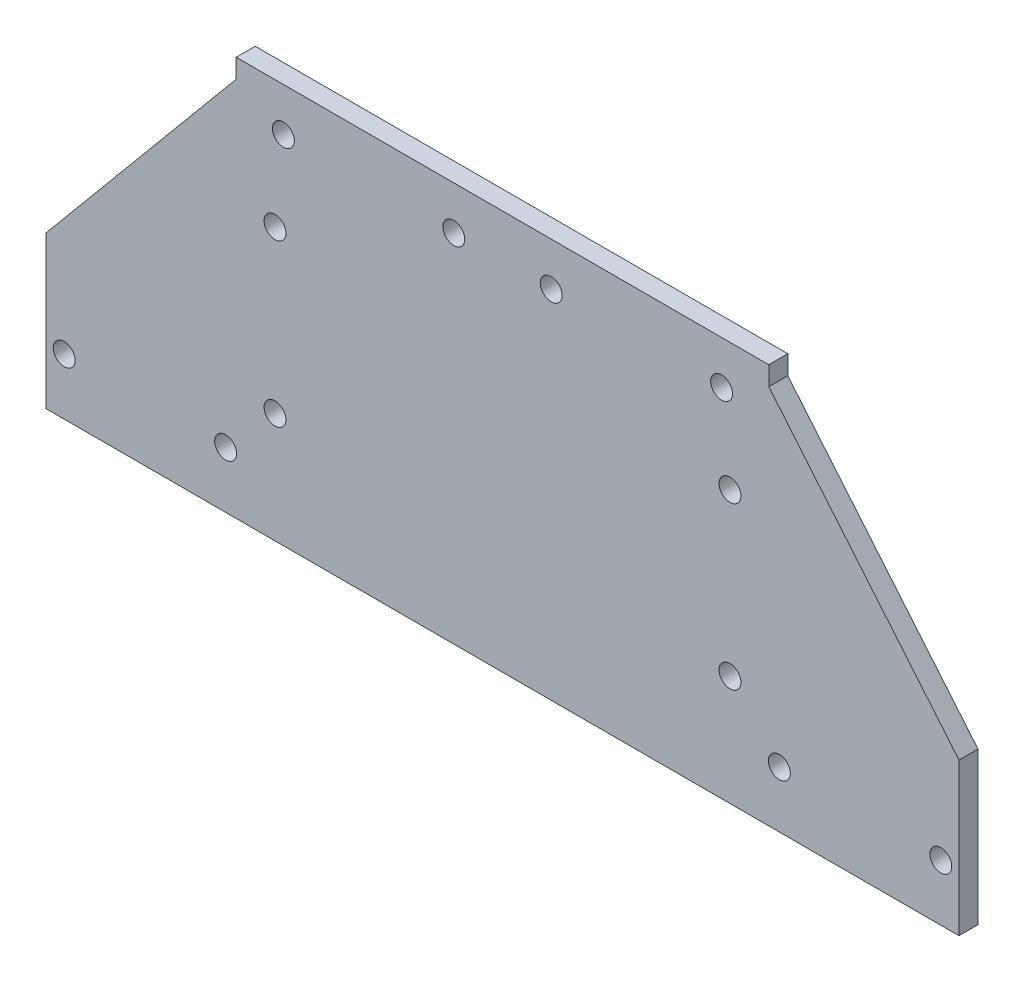
ISO-10303-21;
HEADER;
FILE_DESCRIPTION(('STEP AP214'),'2;1');
FILE_NAME('part.step','',(''),(''),'','','');
FILE_SCHEMA(('AUTOMOTIVE_DESIGN { 1 0 10303 214 1 1 1 1 }'));
ENDSEC;
DATA;
#1=APPLICATION_CONTEXT('core data for automotive mechanical design processes');
#2=APPLICATION_PROTOCOL_DEFINITION('international standard','automotive_design',2000,#1);
#3=PRODUCT_CONTEXT('',#1,'mechanical');
#4=PRODUCT('Part','Part','',(#3));
#5=PRODUCT_RELATED_PRODUCT_CATEGORY('part','',(#4));
#6=PRODUCT_DEFINITION_FORMATION('','',#4);
#7=PRODUCT_DEFINITION_CONTEXT('part definition',#1,'design');
#8=PRODUCT_DEFINITION('design','',#6,#7);
#9=PRODUCT_DEFINITION_SHAPE('','',#8);
#10=(LENGTH_UNIT() NAMED_UNIT(*) SI_UNIT(.MILLI.,.METRE.));
#11=(NAMED_UNIT(*) PLANE_ANGLE_UNIT() SI_UNIT($,.RADIAN.));
#12=(NAMED_UNIT(*) SI_UNIT($,.STERADIAN.) SOLID_ANGLE_UNIT());
#13=UNCERTAINTY_MEASURE_WITH_UNIT(LENGTH_MEASURE(1.E-05),#10,'distance_accuracy_value','');
#14=(GEOMETRIC_REPRESENTATION_CONTEXT(3) GLOBAL_UNCERTAINTY_ASSIGNED_CONTEXT((#13)) GLOBAL_UNIT_ASSIGNED_CONTEXT((#10,
#11,#12)) REPRESENTATION_CONTEXT('',''));
#15=CARTESIAN_POINT('',(0.,0.,0.));
#16=DIRECTION('',(0.,0.,1.));
#17=DIRECTION('',(1.,0.,0.));
#18=AXIS2_PLACEMENT_3D('',#15,#16,#17);
#19=CARTESIAN_POINT('',(44.45,51.435,1.58749999999999));
#20=DIRECTION('',(0.,0.,-1.));
#21=DIRECTION('',(-1.,0.,0.));
#22=AXIS2_PLACEMENT_3D('',#19,#20,#21);
#23=PLANE('',#22);
#24=CARTESIAN_POINT('',(73.1647,-5.84200000000002,1.5875));
#25=DIRECTION('',(0.,0.,1.));
#26=DIRECTION('',(-1.,0.,0.));
#27=AXIS2_PLACEMENT_3D('',#24,#25,#26);
#28=CIRCLE('',#27,1.82880000000003);
#29=CARTESIAN_POINT('',(71.3359,-5.84200000000002,1.5875));
#30=VERTEX_POINT('',#29);
#31=EDGE_CURVE('E228',#30,#30,#28,.T.);
#32=ORIENTED_EDGE('',*,*,#31,.F.);
#33=EDGE_LOOP('',(#32));
#34=FACE_BOUND('',#33,.T.);
#35=CARTESIAN_POINT('',(46.2153,-5.84200000000002,1.5875));
#36=DIRECTION('',(0.,0.,1.));
#37=DIRECTION('',(-1.,0.,0.));
#38=AXIS2_PLACEMENT_3D('',#35,#36,#37);
#39=CIRCLE('',#38,1.8288);
#40=CARTESIAN_POINT('',(44.3865,-5.84200000000002,1.5875));
#41=VERTEX_POINT('',#40);
#42=EDGE_CURVE('E222',#41,#41,#39,.T.);
#43=ORIENTED_EDGE('',*,*,#42,.F.);
#44=EDGE_LOOP('',(#43));
#45=FACE_BOUND('',#44,.T.);
#46=CARTESIAN_POINT('',(-46.2153,-5.84200000000001,1.5875));
#47=DIRECTION('',(0.,0.,1.));
#48=DIRECTION('',(1.,0.,0.));
#49=AXIS2_PLACEMENT_3D('',#46,#47,#48);
#50=CIRCLE('',#49,1.8288);
#51=CARTESIAN_POINT('',(-44.3865,-5.84200000000001,1.5875));
#52=VERTEX_POINT('',#51);
#53=EDGE_CURVE('E216',#52,#52,#50,.T.);
#54=ORIENTED_EDGE('',*,*,#53,.F.);
#55=EDGE_LOOP('',(#54));
#56=FACE_BOUND('',#55,.T.);
#57=CARTESIAN_POINT('',(-73.1647,-5.84200000000001,1.5875));
#58=DIRECTION('',(0.,0.,1.));
#59=DIRECTION('',(1.,0.,0.));
#60=AXIS2_PLACEMENT_3D('',#57,#58,#59);
#61=CIRCLE('',#60,1.8288);
#62=CARTESIAN_POINT('',(-71.3359,-5.84200000000001,1.5875));
#63=VERTEX_POINT('',#62);
#64=EDGE_CURVE('E210',#63,#63,#61,.T.);
#65=ORIENTED_EDGE('',*,*,#64,.F.);
#66=EDGE_LOOP('',(#65));
#67=FACE_BOUND('',#66,.T.);
#68=CARTESIAN_POINT('',(-36.576,44.196,1.5875));
#69=DIRECTION('',(0.,0.,1.));
#70=DIRECTION('',(1.,0.,0.));
#71=AXIS2_PLACEMENT_3D('',#68,#69,#70);
#72=CIRCLE('',#71,1.8288);
#73=CARTESIAN_POINT('',(-34.7472,44.196,1.5875));
#74=VERTEX_POINT('',#73);
#75=EDGE_CURVE('E131',#74,#74,#72,.T.);
#76=ORIENTED_EDGE('',*,*,#75,.F.);
#77=EDGE_LOOP('',(#76));
#78=FACE_BOUND('',#77,.T.);
#79=CARTESIAN_POINT('',(-8.128,44.196,1.5875));
#80=DIRECTION('',(0.,0.,1.));
#81=DIRECTION('',(1.,0.,0.));
#82=AXIS2_PLACEMENT_3D('',#79,#80,#81);
#83=CIRCLE('',#82,1.8288);
#84=CARTESIAN_POINT('',(-6.2992,44.196,1.5875));
#85=VERTEX_POINT('',#84);
#86=EDGE_CURVE('E137',#85,#85,#83,.T.);
#87=ORIENTED_EDGE('',*,*,#86,.F.);
#88=EDGE_LOOP('',(#87));
#89=FACE_BOUND('',#88,.T.);
#90=CARTESIAN_POINT('',(8.128,44.196,1.5875));
#91=DIRECTION('',(0.,0.,1.));
#92=DIRECTION('',(-1.,0.,0.));
#93=AXIS2_PLACEMENT_3D('',#90,#91,#92);
#94=CIRCLE('',#93,1.8288);
#95=CARTESIAN_POINT('',(6.2992,44.196,1.5875));
#96=VERTEX_POINT('',#95);
#97=EDGE_CURVE('E143',#96,#96,#94,.T.);
#98=ORIENTED_EDGE('',*,*,#97,.F.);
#99=EDGE_LOOP('',(#98));
#100=FACE_BOUND('',#99,.T.);
#101=CARTESIAN_POINT('',(36.576,44.196,1.5875));
#102=DIRECTION('',(0.,0.,1.));
#103=DIRECTION('',(-1.,0.,0.));
#104=AXIS2_PLACEMENT_3D('',#101,#102,#103);
#105=CIRCLE('',#104,1.8288);
#106=CARTESIAN_POINT('',(34.7472,44.196,1.5875));
#107=VERTEX_POINT('',#106);
#108=EDGE_CURVE('E149',#107,#107,#105,.T.);
#109=ORIENTED_EDGE('',*,*,#108,.F.);
#110=EDGE_LOOP('',(#109));
#111=FACE_BOUND('',#110,.T.);
#112=CARTESIAN_POINT('',(-37.973,3.175,1.5875));
#113=DIRECTION('',(0.,0.,1.));
#114=DIRECTION('',(1.,0.,0.));
#115=AXIS2_PLACEMENT_3D('',#112,#113,#114);
#116=CIRCLE('',#115,1.8288);
#117=CARTESIAN_POINT('',(-36.1442,3.175,1.5875));
#118=VERTEX_POINT('',#117);
#119=EDGE_CURVE('E155',#118,#118,#116,.T.);
#120=ORIENTED_EDGE('',*,*,#119,.F.);
#121=EDGE_LOOP('',(#120));
#122=FACE_BOUND('',#121,.T.);
#123=CARTESIAN_POINT('',(-37.973,30.1244,1.5875));
#124=DIRECTION('',(0.,0.,1.));
#125=DIRECTION('',(1.,0.,0.));
#126=AXIS2_PLACEMENT_3D('',#123,#124,#125);
#127=CIRCLE('',#126,1.8288);
#128=CARTESIAN_POINT('',(-36.1442,30.1244,1.5875));
#129=VERTEX_POINT('',#128);
#130=EDGE_CURVE('E161',#129,#129,#127,.T.);
#131=ORIENTED_EDGE('',*,*,#130,.F.);
#132=EDGE_LOOP('',(#131));
#133=FACE_BOUND('',#132,.T.);
#134=CARTESIAN_POINT('',(37.973,3.17500000000001,1.5875));
#135=DIRECTION('',(0.,0.,1.));
#136=DIRECTION('',(-1.,0.,0.));
#137=AXIS2_PLACEMENT_3D('',#134,#135,#136);
#138=CIRCLE('',#137,1.8288);
#139=CARTESIAN_POINT('',(36.1442,3.17500000000001,1.5875));
#140=VERTEX_POINT('',#139);
#141=EDGE_CURVE('E167',#140,#140,#138,.T.);
#142=ORIENTED_EDGE('',*,*,#141,.F.);
#143=EDGE_LOOP('',(#142));
#144=FACE_BOUND('',#143,.T.);
#145=CARTESIAN_POINT('',(37.973,30.1244,1.5875));
#146=DIRECTION('',(0.,0.,1.));
#147=DIRECTION('',(-1.,0.,0.));
#148=AXIS2_PLACEMENT_3D('',#145,#146,#147);
#149=CIRCLE('',#148,1.8288);
#150=CARTESIAN_POINT('',(36.1442,30.1244,1.5875));
#151=VERTEX_POINT('',#150);
#152=EDGE_CURVE('E114',#151,#151,#149,.T.);
#153=ORIENTED_EDGE('',*,*,#152,.F.);
#154=EDGE_LOOP('',(#153));
#155=FACE_BOUND('',#154,.T.);
#156=DIRECTION('',(0.,1.,0.));
#157=VECTOR('',#156,1.);
#158=CARTESIAN_POINT('',(76.2,0.,1.5875));
#159=LINE('',#158,#157);
#160=CARTESIAN_POINT('',(76.2,-15.24,1.5875));
#161=VERTEX_POINT('',#160);
#162=CARTESIAN_POINT('',(76.2,10.16,1.5875));
#163=VERTEX_POINT('',#162);
#164=EDGE_CURVE('E186',#161,#163,#159,.T.);
#165=ORIENTED_EDGE('',*,*,#164,.T.);
#166=DIRECTION('',(0.64018439966448,-0.768221279597376,0.));
#167=VECTOR('',#166,1.);
#168=CARTESIAN_POINT('',(49.9672131147541,41.6393442622951,1.5875));
#169=LINE('',#168,#167);
#170=CARTESIAN_POINT('',(44.45,48.26,1.5875));
#171=VERTEX_POINT('',#170);
#172=EDGE_CURVE('E48',#171,#163,#169,.T.);
#173=ORIENTED_EDGE('',*,*,#172,.F.);
#174=DIRECTION('',(0.,-1.,0.));
#175=VECTOR('',#174,1.);
#176=CARTESIAN_POINT('',(44.45,51.435,1.58749999999999));
#177=LINE('',#176,#175);
#178=CARTESIAN_POINT('',(44.45,51.435,1.58749999999999));
#179=VERTEX_POINT('',#178);
#180=EDGE_CURVE('E41',#179,#171,#177,.T.);
#181=ORIENTED_EDGE('',*,*,#180,.F.);
#182=DIRECTION('',(1.,0.,0.));
#183=VECTOR('',#182,1.);
#184=CARTESIAN_POINT('',(44.45,51.435,1.58749999999999));
#185=LINE('',#184,#183);
#186=CARTESIAN_POINT('',(-44.45,51.435,1.58750000000001));
#187=VERTEX_POINT('',#186);
#188=EDGE_CURVE('E126',#187,#179,#185,.T.);
#189=ORIENTED_EDGE('',*,*,#188,.F.);
#190=DIRECTION('',(0.,-1.,0.));
#191=VECTOR('',#190,1.);
#192=CARTESIAN_POINT('',(-44.45,51.435,1.58750000000001));
#193=LINE('',#192,#191);
#194=CARTESIAN_POINT('',(-44.45,48.26,1.5875));
#195=VERTEX_POINT('',#194);
#196=EDGE_CURVE('E11',#187,#195,#193,.T.);
#197=ORIENTED_EDGE('',*,*,#196,.T.);
#198=DIRECTION('',(-0.64018439966448,-0.768221279597376,0.));
#199=VECTOR('',#198,1.);
#200=CARTESIAN_POINT('',(-49.9672131147541,41.6393442622951,1.5875));
#201=LINE('',#200,#199);
#202=CARTESIAN_POINT('',(-76.2,10.16,1.5875));
#203=VERTEX_POINT('',#202);
#204=EDGE_CURVE('E203',#195,#203,#201,.T.);
#205=ORIENTED_EDGE('',*,*,#204,.T.);
#206=DIRECTION('',(0.,-1.,0.));
#207=VECTOR('',#206,1.);
#208=CARTESIAN_POINT('',(-76.2,0.,1.5875));
#209=LINE('',#208,#207);
#210=CARTESIAN_POINT('',(-76.2,-15.24,1.5875));
#211=VERTEX_POINT('',#210);
#212=EDGE_CURVE('E193',#203,#211,#209,.T.);
#213=ORIENTED_EDGE('',*,*,#212,.T.);
#214=DIRECTION('',(1.,0.,0.));
#215=VECTOR('',#214,1.);
#216=CARTESIAN_POINT('',(76.2,-15.24,1.5875));
#217=LINE('',#216,#215);
#218=EDGE_CURVE('E190',#211,#161,#217,.T.);
#219=ORIENTED_EDGE('',*,*,#218,.T.);
#220=EDGE_LOOP('',(#165,#173,#181,#189,#197,#205,#213,#219));
#221=FACE_BOUND('',#220,.T.);
#222=ADVANCED_FACE('F33',(#34,#45,#56,#67,#78,#89,#100,#111,#122,#133,#144,#155,#221),#23,.F.);
#223=CARTESIAN_POINT('',(44.45,51.435,-1.58750000000001));
#224=DIRECTION('',(0.,0.,1.));
#225=DIRECTION('',(1.,0.,0.));
#226=AXIS2_PLACEMENT_3D('',#223,#224,#225);
#227=PLANE('',#226);
#228=CARTESIAN_POINT('',(73.1647,-5.84200000000002,-1.58750000000001));
#229=DIRECTION('',(0.,0.,1.));
#230=DIRECTION('',(-1.,0.,0.));
#231=AXIS2_PLACEMENT_3D('',#228,#229,#230);
#232=CIRCLE('',#231,1.82880000000003);
#233=CARTESIAN_POINT('',(71.3359,-5.84200000000002,-1.58750000000001));
#234=VERTEX_POINT('',#233);
#235=EDGE_CURVE('E225',#234,#234,#232,.T.);
#236=ORIENTED_EDGE('',*,*,#235,.T.);
#237=EDGE_LOOP('',(#236));
#238=FACE_BOUND('',#237,.T.);
#239=CARTESIAN_POINT('',(46.2153,-5.84200000000002,-1.58750000000001));
#240=DIRECTION('',(0.,0.,1.));
#241=DIRECTION('',(-1.,0.,0.));
#242=AXIS2_PLACEMENT_3D('',#239,#240,#241);
#243=CIRCLE('',#242,1.8288);
#244=CARTESIAN_POINT('',(44.3865,-5.84200000000002,-1.58750000000001));
#245=VERTEX_POINT('',#244);
#246=EDGE_CURVE('E219',#245,#245,#243,.T.);
#247=ORIENTED_EDGE('',*,*,#246,.T.);
#248=EDGE_LOOP('',(#247));
#249=FACE_BOUND('',#248,.T.);
#250=CARTESIAN_POINT('',(-46.2153,-5.84200000000001,-1.58750000000001));
#251=DIRECTION('',(0.,0.,1.));
#252=DIRECTION('',(1.,0.,0.));
#253=AXIS2_PLACEMENT_3D('',#250,#251,#252);
#254=CIRCLE('',#253,1.8288);
#255=CARTESIAN_POINT('',(-44.3865,-5.84200000000001,-1.58750000000001));
#256=VERTEX_POINT('',#255);
#257=EDGE_CURVE('E213',#256,#256,#254,.T.);
#258=ORIENTED_EDGE('',*,*,#257,.T.);
#259=EDGE_LOOP('',(#258));
#260=FACE_BOUND('',#259,.T.);
#261=CARTESIAN_POINT('',(-73.1647,-5.84200000000001,-1.58750000000001));
#262=DIRECTION('',(0.,0.,1.));
#263=DIRECTION('',(1.,0.,0.));
#264=AXIS2_PLACEMENT_3D('',#261,#262,#263);
#265=CIRCLE('',#264,1.8288);
#266=CARTESIAN_POINT('',(-71.3359,-5.84200000000001,-1.58750000000001));
#267=VERTEX_POINT('',#266);
#268=EDGE_CURVE('E208',#267,#267,#265,.T.);
#269=ORIENTED_EDGE('',*,*,#268,.T.);
#270=EDGE_LOOP('',(#269));
#271=FACE_BOUND('',#270,.T.);
#272=CARTESIAN_POINT('',(-36.576,44.196,-1.58750000000001));
#273=DIRECTION('',(0.,0.,1.));
#274=DIRECTION('',(1.,0.,0.));
#275=AXIS2_PLACEMENT_3D('',#272,#273,#274);
#276=CIRCLE('',#275,1.8288);
#277=CARTESIAN_POINT('',(-34.7472,44.196,-1.58750000000001));
#278=VERTEX_POINT('',#277);
#279=EDGE_CURVE('E130',#278,#278,#276,.T.);
#280=ORIENTED_EDGE('',*,*,#279,.T.);
#281=EDGE_LOOP('',(#280));
#282=FACE_BOUND('',#281,.T.);
#283=CARTESIAN_POINT('',(-8.128,44.196,-1.58750000000001));
#284=DIRECTION('',(0.,0.,1.));
#285=DIRECTION('',(1.,0.,0.));
#286=AXIS2_PLACEMENT_3D('',#283,#284,#285);
#287=CIRCLE('',#286,1.8288);
#288=CARTESIAN_POINT('',(-6.2992,44.196,-1.58750000000001));
#289=VERTEX_POINT('',#288);
#290=EDGE_CURVE('E134',#289,#289,#287,.T.);
#291=ORIENTED_EDGE('',*,*,#290,.T.);
#292=EDGE_LOOP('',(#291));
#293=FACE_BOUND('',#292,.T.);
#294=CARTESIAN_POINT('',(8.128,44.196,-1.58750000000001));
#295=DIRECTION('',(0.,0.,1.));
#296=DIRECTION('',(-1.,0.,0.));
#297=AXIS2_PLACEMENT_3D('',#294,#295,#296);
#298=CIRCLE('',#297,1.8288);
#299=CARTESIAN_POINT('',(6.2992,44.196,-1.58750000000001));
#300=VERTEX_POINT('',#299);
#301=EDGE_CURVE('E140',#300,#300,#298,.T.);
#302=ORIENTED_EDGE('',*,*,#301,.T.);
#303=EDGE_LOOP('',(#302));
#304=FACE_BOUND('',#303,.T.);
#305=CARTESIAN_POINT('',(36.576,44.196,-1.58750000000001));
#306=DIRECTION('',(0.,0.,1.));
#307=DIRECTION('',(-1.,0.,0.));
#308=AXIS2_PLACEMENT_3D('',#305,#306,#307);
#309=CIRCLE('',#308,1.8288);
#310=CARTESIAN_POINT('',(34.7472,44.196,-1.58750000000001));
#311=VERTEX_POINT('',#310);
#312=EDGE_CURVE('E146',#311,#311,#309,.T.);
#313=ORIENTED_EDGE('',*,*,#312,.T.);
#314=EDGE_LOOP('',(#313));
#315=FACE_BOUND('',#314,.T.);
#316=CARTESIAN_POINT('',(-37.973,3.175,-1.58750000000001));
#317=DIRECTION('',(0.,0.,1.));
#318=DIRECTION('',(1.,0.,0.));
#319=AXIS2_PLACEMENT_3D('',#316,#317,#318);
#320=CIRCLE('',#319,1.8288);
#321=CARTESIAN_POINT('',(-36.1442,3.175,-1.58750000000001));
#322=VERTEX_POINT('',#321);
#323=EDGE_CURVE('E152',#322,#322,#320,.T.);
#324=ORIENTED_EDGE('',*,*,#323,.T.);
#325=EDGE_LOOP('',(#324));
#326=FACE_BOUND('',#325,.T.);
#327=CARTESIAN_POINT('',(-37.973,30.1244,-1.58750000000001));
#328=DIRECTION('',(0.,0.,1.));
#329=DIRECTION('',(1.,0.,0.));
#330=AXIS2_PLACEMENT_3D('',#327,#328,#329);
#331=CIRCLE('',#330,1.8288);
#332=CARTESIAN_POINT('',(-36.1442,30.1244,-1.58750000000001));
#333=VERTEX_POINT('',#332);
#334=EDGE_CURVE('E158',#333,#333,#331,.T.);
#335=ORIENTED_EDGE('',*,*,#334,.T.);
#336=EDGE_LOOP('',(#335));
#337=FACE_BOUND('',#336,.T.);
#338=CARTESIAN_POINT('',(37.973,3.17500000000001,-1.58750000000001));
#339=DIRECTION('',(0.,0.,1.));
#340=DIRECTION('',(-1.,0.,0.));
#341=AXIS2_PLACEMENT_3D('',#338,#339,#340);
#342=CIRCLE('',#341,1.8288);
#343=CARTESIAN_POINT('',(36.1442,3.17500000000001,-1.58750000000001));
#344=VERTEX_POINT('',#343);
#345=EDGE_CURVE('E164',#344,#344,#342,.T.);
#346=ORIENTED_EDGE('',*,*,#345,.T.);
#347=EDGE_LOOP('',(#346));
#348=FACE_BOUND('',#347,.T.);
#349=CARTESIAN_POINT('',(37.973,30.1244,-1.58750000000001));
#350=DIRECTION('',(0.,0.,1.));
#351=DIRECTION('',(-1.,0.,0.));
#352=AXIS2_PLACEMENT_3D('',#349,#350,#351);
#353=CIRCLE('',#352,1.8288);
#354=CARTESIAN_POINT('',(36.1442,30.1244,-1.58750000000001));
#355=VERTEX_POINT('',#354);
#356=EDGE_CURVE('E170',#355,#355,#353,.T.);
#357=ORIENTED_EDGE('',*,*,#356,.T.);
#358=EDGE_LOOP('',(#357));
#359=FACE_BOUND('',#358,.T.);
#360=DIRECTION('',(0.,-1.,0.));
#361=VECTOR('',#360,1.);
#362=CARTESIAN_POINT('',(44.45,51.435,-1.58750000000001));
#363=LINE('',#362,#361);
#364=CARTESIAN_POINT('',(44.45,51.435,-1.58750000000001));
#365=VERTEX_POINT('',#364);
#366=CARTESIAN_POINT('',(44.45,48.26,-1.58750000000001));
#367=VERTEX_POINT('',#366);
#368=EDGE_CURVE('E112',#365,#367,#363,.T.);
#369=ORIENTED_EDGE('',*,*,#368,.T.);
#370=DIRECTION('',(0.64018439966448,-0.768221279597376,0.));
#371=VECTOR('',#370,1.);
#372=CARTESIAN_POINT('',(49.9672131147541,41.6393442622951,-1.58750000000001));
#373=LINE('',#372,#371);
#374=CARTESIAN_POINT('',(76.2,10.16,-1.58750000000001));
#375=VERTEX_POINT('',#374);
#376=EDGE_CURVE('E97',#367,#375,#373,.T.);
#377=ORIENTED_EDGE('',*,*,#376,.T.);
#378=DIRECTION('',(0.,1.,0.));
#379=VECTOR('',#378,1.);
#380=CARTESIAN_POINT('',(76.2,0.,-1.5875));
#381=LINE('',#380,#379);
#382=CARTESIAN_POINT('',(76.2,-15.24,-1.5875));
#383=VERTEX_POINT('',#382);
#384=EDGE_CURVE('E181',#383,#375,#381,.T.);
#385=ORIENTED_EDGE('',*,*,#384,.F.);
#386=DIRECTION('',(1.,0.,0.));
#387=VECTOR('',#386,1.);
#388=CARTESIAN_POINT('',(76.2,-15.24,-1.5875));
#389=LINE('',#388,#387);
#390=CARTESIAN_POINT('',(-76.2,-15.24,-1.5875));
#391=VERTEX_POINT('',#390);
#392=EDGE_CURVE('E197',#391,#383,#389,.T.);
#393=ORIENTED_EDGE('',*,*,#392,.F.);
#394=DIRECTION('',(0.,-1.,0.));
#395=VECTOR('',#394,1.);
#396=CARTESIAN_POINT('',(-76.2,0.,-1.5875));
#397=LINE('',#396,#395);
#398=CARTESIAN_POINT('',(-76.2,10.16,-1.58750000000001));
#399=VERTEX_POINT('',#398);
#400=EDGE_CURVE('E189',#399,#391,#397,.T.);
#401=ORIENTED_EDGE('',*,*,#400,.F.);
#402=DIRECTION('',(-0.64018439966448,-0.768221279597376,0.));
#403=VECTOR('',#402,1.);
#404=CARTESIAN_POINT('',(-49.9672131147541,41.6393442622951,-1.58750000000001));
#405=LINE('',#404,#403);
#406=CARTESIAN_POINT('',(-44.45,48.26,-1.58750000000001));
#407=VERTEX_POINT('',#406);
#408=EDGE_CURVE('E202',#407,#399,#405,.T.);
#409=ORIENTED_EDGE('',*,*,#408,.F.);
#410=DIRECTION('',(0.,-1.,0.));
#411=VECTOR('',#410,1.);
#412=CARTESIAN_POINT('',(-44.45,51.435,-1.58749999999999));
#413=LINE('',#412,#411);
#414=CARTESIAN_POINT('',(-44.45,51.435,-1.58749999999999));
#415=VERTEX_POINT('',#414);
#416=EDGE_CURVE('E118',#415,#407,#413,.T.);
#417=ORIENTED_EDGE('',*,*,#416,.F.);
#418=DIRECTION('',(-1.,0.,0.));
#419=VECTOR('',#418,1.);
#420=CARTESIAN_POINT('',(44.45,51.435,-1.58750000000001));
#421=LINE('',#420,#419);
#422=EDGE_CURVE('E56',#365,#415,#421,.T.);
#423=ORIENTED_EDGE('',*,*,#422,.F.);
#424=EDGE_LOOP('',(#369,#377,#385,#393,#401,#409,#417,#423));
#425=FACE_BOUND('',#424,.T.);
#426=ADVANCED_FACE('F117',(#238,#249,#260,#271,#282,#293,#304,#315,#326,#337,#348,#359,#425),
#227,.F.);
#427=CARTESIAN_POINT('',(-76.2,0.,-1.5875));
#428=DIRECTION('',(-1.,0.,0.));
#429=DIRECTION('',(0.,0.,1.));
#430=AXIS2_PLACEMENT_3D('',#427,#428,#429);
#431=PLANE('',#430);
#432=ORIENTED_EDGE('',*,*,#212,.F.);
#433=DIRECTION('',(0.,0.,1.));
#434=VECTOR('',#433,1.);
#435=CARTESIAN_POINT('',(-76.2,10.16,-1.58750000000001));
#436=LINE('',#435,#434);
#437=EDGE_CURVE('E195',#399,#203,#436,.T.);
#438=ORIENTED_EDGE('',*,*,#437,.F.);
#439=ORIENTED_EDGE('',*,*,#400,.T.);
#440=DIRECTION('',(0.,0.,1.));
#441=VECTOR('',#440,1.);
#442=CARTESIAN_POINT('',(-76.2,-15.24,-1.5875));
#443=LINE('',#442,#441);
#444=EDGE_CURVE('E180',#391,#211,#443,.T.);
#445=ORIENTED_EDGE('',*,*,#444,.T.);
#446=EDGE_LOOP('',(#432,#438,#439,#445));
#447=FACE_BOUND('',#446,.T.);
#448=ADVANCED_FACE('F279',(#447),#431,.T.);
#449=CARTESIAN_POINT('',(-44.45,51.435,1.58750000000001));
#450=DIRECTION('',(1.,0.,0.));
#451=DIRECTION('',(0.,0.,-1.));
#452=AXIS2_PLACEMENT_3D('',#449,#450,#451);
#453=PLANE('',#452);
#454=ORIENTED_EDGE('',*,*,#416,.T.);
#455=DIRECTION('',(0.,0.,1.));
#456=VECTOR('',#455,1.);
#457=CARTESIAN_POINT('',(-44.45,48.26,-1.5875));
#458=LINE('',#457,#456);
#459=EDGE_CURVE('E177',#407,#195,#458,.T.);
#460=ORIENTED_EDGE('',*,*,#459,.T.);
#461=ORIENTED_EDGE('',*,*,#196,.F.);
#462=DIRECTION('',(0.,0.,1.));
#463=VECTOR('',#462,1.);
#464=CARTESIAN_POINT('',(-44.45,51.435,1.58750000000001));
#465=LINE('',#464,#463);
#466=EDGE_CURVE('E128',#415,#187,#465,.T.);
#467=ORIENTED_EDGE('',*,*,#466,.F.);
#468=EDGE_LOOP('',(#454,#460,#461,#467));
#469=FACE_BOUND('',#468,.T.);
#470=ADVANCED_FACE('F35',(#469),#453,.F.);
#471=CARTESIAN_POINT('',(44.45,51.435,1.58749999999999));
#472=DIRECTION('',(-1.,0.,0.));
#473=DIRECTION('',(0.,0.,1.));
#474=AXIS2_PLACEMENT_3D('',#471,#472,#473);
#475=PLANE('',#474);
#476=ORIENTED_EDGE('',*,*,#180,.T.);
#477=DIRECTION('',(0.,0.,1.));
#478=VECTOR('',#477,1.);
#479=CARTESIAN_POINT('',(44.45,48.26,-1.5875));
#480=LINE('',#479,#478);
#481=EDGE_CURVE('E100',#367,#171,#480,.T.);
#482=ORIENTED_EDGE('',*,*,#481,.F.);
#483=ORIENTED_EDGE('',*,*,#368,.F.);
#484=DIRECTION('',(0.,0.,-1.));
#485=VECTOR('',#484,1.);
#486=CARTESIAN_POINT('',(44.45,51.435,1.58749999999999));
#487=LINE('',#486,#485);
#488=EDGE_CURVE('E124',#179,#365,#487,.T.);
#489=ORIENTED_EDGE('',*,*,#488,.F.);
#490=EDGE_LOOP('',(#476,#482,#483,#489));
#491=FACE_BOUND('',#490,.T.);
#492=ADVANCED_FACE('F110',(#491),#475,.F.);
#493=CARTESIAN_POINT('',(0.,51.435,0.));
#494=DIRECTION('',(0.,1.,0.));
#495=DIRECTION('',(0.,0.,1.));
#496=AXIS2_PLACEMENT_3D('',#493,#494,#495);
#497=PLANE('',#496);
#498=ORIENTED_EDGE('',*,*,#466,.T.);
#499=ORIENTED_EDGE('',*,*,#188,.T.);
#500=ORIENTED_EDGE('',*,*,#488,.T.);
#501=ORIENTED_EDGE('',*,*,#422,.T.);
#502=EDGE_LOOP('',(#498,#499,#500,#501));
#503=FACE_BOUND('',#502,.T.);
#504=ADVANCED_FACE('F285',(#503),#497,.T.);
#505=CARTESIAN_POINT('',(-36.576,44.196,-1.58750000000001));
#506=DIRECTION('',(0.,0.,1.));
#507=DIRECTION('',(1.,0.,0.));
#508=AXIS2_PLACEMENT_3D('',#505,#506,#507);
#509=CYLINDRICAL_SURFACE('',#508,1.8288);
#510=ORIENTED_EDGE('',*,*,#279,.F.);
#511=EDGE_LOOP('',(#510));
#512=FACE_BOUND('',#511,.T.);
#513=ORIENTED_EDGE('',*,*,#75,.T.);
#514=EDGE_LOOP('',(#513));
#515=FACE_BOUND('',#514,.T.);
#516=ADVANCED_FACE('F287',(#512,#515),#509,.F.);
#517=CARTESIAN_POINT('',(-8.128,44.196,-1.58750000000001));
#518=DIRECTION('',(0.,0.,1.));
#519=DIRECTION('',(1.,0.,0.));
#520=AXIS2_PLACEMENT_3D('',#517,#518,#519);
#521=CYLINDRICAL_SURFACE('',#520,1.8288);
#522=ORIENTED_EDGE('',*,*,#290,.F.);
#523=EDGE_LOOP('',(#522));
#524=FACE_BOUND('',#523,.T.);
#525=ORIENTED_EDGE('',*,*,#86,.T.);
#526=EDGE_LOOP('',(#525));
#527=FACE_BOUND('',#526,.T.);
#528=ADVANCED_FACE('F293',(#524,#527),#521,.F.);
#529=CARTESIAN_POINT('',(8.128,44.196,-1.58750000000001));
#530=DIRECTION('',(0.,0.,1.));
#531=DIRECTION('',(1.,0.,0.));
#532=AXIS2_PLACEMENT_3D('',#529,#530,#531);
#533=CYLINDRICAL_SURFACE('',#532,1.8288);
#534=ORIENTED_EDGE('',*,*,#301,.F.);
#535=EDGE_LOOP('',(#534));
#536=FACE_BOUND('',#535,.T.);
#537=ORIENTED_EDGE('',*,*,#97,.T.);
#538=EDGE_LOOP('',(#537));
#539=FACE_BOUND('',#538,.T.);
#540=ADVANCED_FACE('F329',(#536,#539),#533,.F.);
#541=CARTESIAN_POINT('',(36.576,44.196,-1.58750000000001));
#542=DIRECTION('',(0.,0.,1.));
#543=DIRECTION('',(1.,0.,0.));
#544=AXIS2_PLACEMENT_3D('',#541,#542,#543);
#545=CYLINDRICAL_SURFACE('',#544,1.8288);
#546=ORIENTED_EDGE('',*,*,#312,.F.);
#547=EDGE_LOOP('',(#546));
#548=FACE_BOUND('',#547,.T.);
#549=ORIENTED_EDGE('',*,*,#108,.T.);
#550=EDGE_LOOP('',(#549));
#551=FACE_BOUND('',#550,.T.);
#552=ADVANCED_FACE('F325',(#548,#551),#545,.F.);
#553=CARTESIAN_POINT('',(-37.973,3.175,-1.58750000000001));
#554=DIRECTION('',(0.,0.,1.));
#555=DIRECTION('',(1.,0.,0.));
#556=AXIS2_PLACEMENT_3D('',#553,#554,#555);
#557=CYLINDRICAL_SURFACE('',#556,1.8288);
#558=ORIENTED_EDGE('',*,*,#323,.F.);
#559=EDGE_LOOP('',(#558));
#560=FACE_BOUND('',#559,.T.);
#561=ORIENTED_EDGE('',*,*,#119,.T.);
#562=EDGE_LOOP('',(#561));
#563=FACE_BOUND('',#562,.T.);
#564=ADVANCED_FACE('F321',(#560,#563),#557,.F.);
#565=CARTESIAN_POINT('',(-37.973,30.1244,-1.58750000000001));
#566=DIRECTION('',(0.,0.,1.));
#567=DIRECTION('',(1.,0.,0.));
#568=AXIS2_PLACEMENT_3D('',#565,#566,#567);
#569=CYLINDRICAL_SURFACE('',#568,1.8288);
#570=ORIENTED_EDGE('',*,*,#334,.F.);
#571=EDGE_LOOP('',(#570));
#572=FACE_BOUND('',#571,.T.);
#573=ORIENTED_EDGE('',*,*,#130,.T.);
#574=EDGE_LOOP('',(#573));
#575=FACE_BOUND('',#574,.T.);
#576=ADVANCED_FACE('F317',(#572,#575),#569,.F.);
#577=CARTESIAN_POINT('',(37.973,3.17500000000001,-1.58750000000001));
#578=DIRECTION('',(0.,0.,1.));
#579=DIRECTION('',(1.,0.,0.));
#580=AXIS2_PLACEMENT_3D('',#577,#578,#579);
#581=CYLINDRICAL_SURFACE('',#580,1.8288);
#582=ORIENTED_EDGE('',*,*,#345,.F.);
#583=EDGE_LOOP('',(#582));
#584=FACE_BOUND('',#583,.T.);
#585=ORIENTED_EDGE('',*,*,#141,.T.);
#586=EDGE_LOOP('',(#585));
#587=FACE_BOUND('',#586,.T.);
#588=ADVANCED_FACE('F313',(#584,#587),#581,.F.);
#589=CARTESIAN_POINT('',(37.973,30.1244,-1.58750000000001));
#590=DIRECTION('',(0.,0.,1.));
#591=DIRECTION('',(1.,0.,0.));
#592=AXIS2_PLACEMENT_3D('',#589,#590,#591);
#593=CYLINDRICAL_SURFACE('',#592,1.8288);
#594=ORIENTED_EDGE('',*,*,#356,.F.);
#595=EDGE_LOOP('',(#594));
#596=FACE_BOUND('',#595,.T.);
#597=ORIENTED_EDGE('',*,*,#152,.T.);
#598=EDGE_LOOP('',(#597));
#599=FACE_BOUND('',#598,.T.);
#600=ADVANCED_FACE('F310',(#596,#599),#593,.F.);
#601=CARTESIAN_POINT('',(76.2,0.,-1.5875));
#602=DIRECTION('',(1.,0.,0.));
#603=DIRECTION('',(0.,0.,-1.));
#604=AXIS2_PLACEMENT_3D('',#601,#602,#603);
#605=PLANE('',#604);
#606=DIRECTION('',(0.,0.,1.));
#607=VECTOR('',#606,1.);
#608=CARTESIAN_POINT('',(76.2,10.16,-1.58750000000001));
#609=LINE('',#608,#607);
#610=EDGE_CURVE('E101',#375,#163,#609,.T.);
#611=ORIENTED_EDGE('',*,*,#610,.T.);
#612=ORIENTED_EDGE('',*,*,#164,.F.);
#613=DIRECTION('',(0.,0.,1.));
#614=VECTOR('',#613,1.);
#615=CARTESIAN_POINT('',(76.2,-15.24,-1.5875));
#616=LINE('',#615,#614);
#617=EDGE_CURVE('E115',#383,#161,#616,.T.);
#618=ORIENTED_EDGE('',*,*,#617,.F.);
#619=ORIENTED_EDGE('',*,*,#384,.T.);
#620=EDGE_LOOP('',(#611,#612,#618,#619));
#621=FACE_BOUND('',#620,.T.);
#622=ADVANCED_FACE('F269',(#621),#605,.T.);
#623=CARTESIAN_POINT('',(76.2,-15.24,-1.5875));
#624=DIRECTION('',(0.,-1.,0.));
#625=DIRECTION('',(0.,0.,-1.));
#626=AXIS2_PLACEMENT_3D('',#623,#624,#625);
#627=PLANE('',#626);
#628=ORIENTED_EDGE('',*,*,#218,.F.);
#629=ORIENTED_EDGE('',*,*,#444,.F.);
#630=ORIENTED_EDGE('',*,*,#392,.T.);
#631=ORIENTED_EDGE('',*,*,#617,.T.);
#632=EDGE_LOOP('',(#628,#629,#630,#631));
#633=FACE_BOUND('',#632,.T.);
#634=ADVANCED_FACE('F271',(#633),#627,.T.);
#635=CARTESIAN_POINT('',(-49.9672131147541,41.6393442622951,-1.58750000000001));
#636=DIRECTION('',(-0.768221279597376,0.64018439966448,0.));
#637=DIRECTION('',(-0.64018439966448,-0.768221279597376,0.));
#638=AXIS2_PLACEMENT_3D('',#635,#636,#637);
#639=PLANE('',#638);
#640=ORIENTED_EDGE('',*,*,#204,.F.);
#641=ORIENTED_EDGE('',*,*,#459,.F.);
#642=ORIENTED_EDGE('',*,*,#408,.T.);
#643=ORIENTED_EDGE('',*,*,#437,.T.);
#644=EDGE_LOOP('',(#640,#641,#642,#643));
#645=FACE_BOUND('',#644,.T.);
#646=ADVANCED_FACE('F281',(#645),#639,.T.);
#647=CARTESIAN_POINT('',(49.9672131147541,41.6393442622951,-1.58750000000001));
#648=DIRECTION('',(-0.768221279597376,-0.640184399664479,0.));
#649=DIRECTION('',(0.640184399664479,-0.768221279597376,0.));
#650=AXIS2_PLACEMENT_3D('',#647,#648,#649);
#651=PLANE('',#650);
#652=ORIENTED_EDGE('',*,*,#172,.T.);
#653=ORIENTED_EDGE('',*,*,#610,.F.);
#654=ORIENTED_EDGE('',*,*,#376,.F.);
#655=ORIENTED_EDGE('',*,*,#481,.T.);
#656=EDGE_LOOP('',(#652,#653,#654,#655));
#657=FACE_BOUND('',#656,.T.);
#658=ADVANCED_FACE('F99',(#657),#651,.F.);
#659=CARTESIAN_POINT('',(-73.1647,-5.84200000000001,-1.58750000000001));
#660=DIRECTION('',(0.,0.,1.));
#661=DIRECTION('',(1.,0.,0.));
#662=AXIS2_PLACEMENT_3D('',#659,#660,#661);
#663=CYLINDRICAL_SURFACE('',#662,1.8288);
#664=ORIENTED_EDGE('',*,*,#268,.F.);
#665=EDGE_LOOP('',(#664));
#666=FACE_BOUND('',#665,.T.);
#667=ORIENTED_EDGE('',*,*,#64,.T.);
#668=EDGE_LOOP('',(#667));
#669=FACE_BOUND('',#668,.T.);
#670=ADVANCED_FACE('F407',(#666,#669),#663,.F.);
#671=CARTESIAN_POINT('',(-46.2153,-5.84200000000001,-1.58750000000001));
#672=DIRECTION('',(0.,0.,1.));
#673=DIRECTION('',(1.,0.,0.));
#674=AXIS2_PLACEMENT_3D('',#671,#672,#673);
#675=CYLINDRICAL_SURFACE('',#674,1.8288);
#676=ORIENTED_EDGE('',*,*,#257,.F.);
#677=EDGE_LOOP('',(#676));
#678=FACE_BOUND('',#677,.T.);
#679=ORIENTED_EDGE('',*,*,#53,.T.);
#680=EDGE_LOOP('',(#679));
#681=FACE_BOUND('',#680,.T.);
#682=ADVANCED_FACE('F415',(#678,#681),#675,.F.);
#683=CARTESIAN_POINT('',(46.2153,-5.84200000000002,-1.58750000000001));
#684=DIRECTION('',(0.,0.,1.));
#685=DIRECTION('',(1.,0.,0.));
#686=AXIS2_PLACEMENT_3D('',#683,#684,#685);
#687=CYLINDRICAL_SURFACE('',#686,1.8288);
#688=ORIENTED_EDGE('',*,*,#246,.F.);
#689=EDGE_LOOP('',(#688));
#690=FACE_BOUND('',#689,.T.);
#691=ORIENTED_EDGE('',*,*,#42,.T.);
#692=EDGE_LOOP('',(#691));
#693=FACE_BOUND('',#692,.T.);
#694=ADVANCED_FACE('F239',(#690,#693),#687,.F.);
#695=CARTESIAN_POINT('',(73.1647,-5.84200000000002,-1.58750000000001));
#696=DIRECTION('',(0.,0.,1.));
#697=DIRECTION('',(1.,0.,0.));
#698=AXIS2_PLACEMENT_3D('',#695,#696,#697);
#699=CYLINDRICAL_SURFACE('',#698,1.82880000000003);
#700=ORIENTED_EDGE('',*,*,#235,.F.);
#701=EDGE_LOOP('',(#700));
#702=FACE_BOUND('',#701,.T.);
#703=ORIENTED_EDGE('',*,*,#31,.T.);
#704=EDGE_LOOP('',(#703));
#705=FACE_BOUND('',#704,.T.);
#706=ADVANCED_FACE('F236',(#702,#705),#699,.F.);
#707=CLOSED_SHELL('',(#222,#426,#448,#470,#492,#504,#516,#528,#540,#552,#564,#576,#588,#600,
#622,#634,#646,#658,#670,#682,#694,#706));
#708=MANIFOLD_SOLID_BREP('B2',#707);
#709=ADVANCED_BREP_SHAPE_REPRESENTATION('',(#18,#708),#14);
#710=SHAPE_DEFINITION_REPRESENTATION(#9,#709);
ENDSEC;
END-ISO-10303-21;
